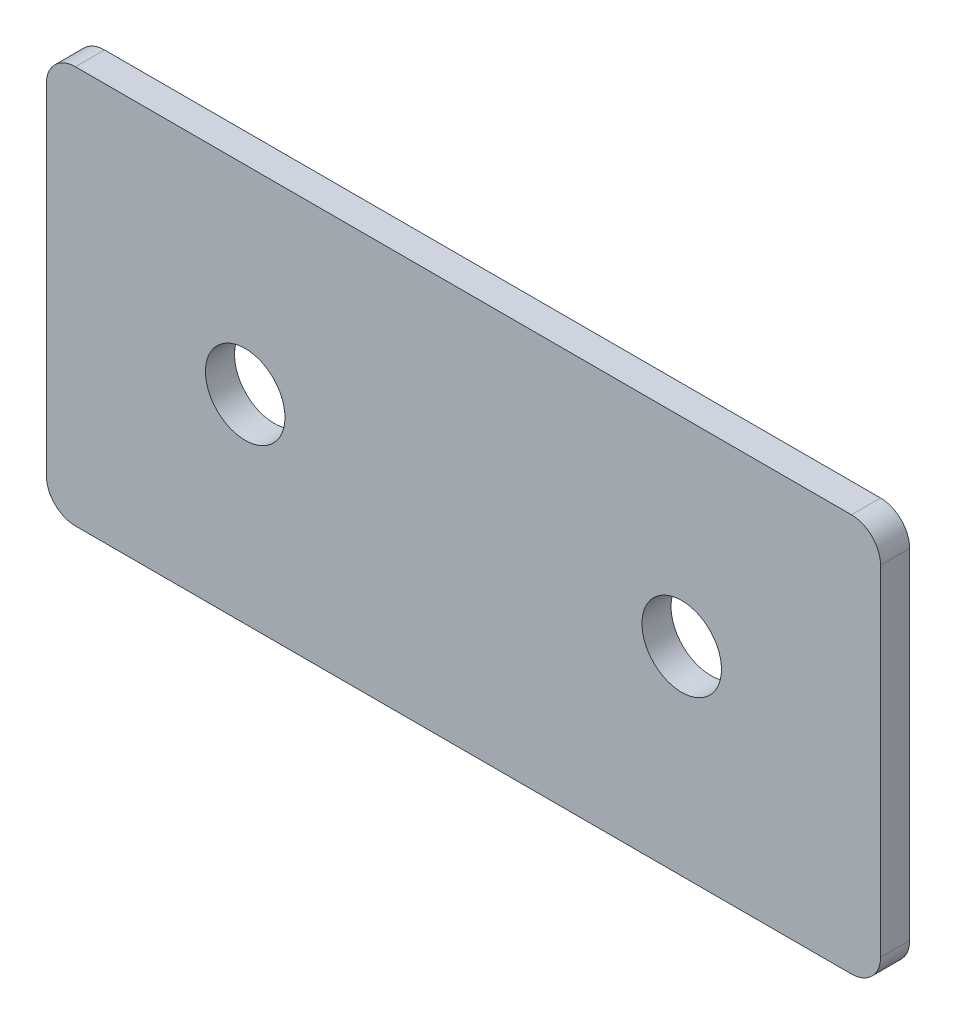
ISO-10303-21;
HEADER;
FILE_DESCRIPTION(('STEP AP214'),'2;1');
FILE_NAME('part.step','',(''),(''),'','','');
FILE_SCHEMA(('AUTOMOTIVE_DESIGN { 1 0 10303 214 1 1 1 1 }'));
ENDSEC;
DATA;
#1=APPLICATION_CONTEXT('core data for automotive mechanical design processes');
#2=APPLICATION_PROTOCOL_DEFINITION('international standard','automotive_design',2000,#1);
#3=PRODUCT_CONTEXT('',#1,'mechanical');
#4=PRODUCT('Part','Part','',(#3));
#5=PRODUCT_RELATED_PRODUCT_CATEGORY('part','',(#4));
#6=PRODUCT_DEFINITION_FORMATION('','',#4);
#7=PRODUCT_DEFINITION_CONTEXT('part definition',#1,'design');
#8=PRODUCT_DEFINITION('design','',#6,#7);
#9=PRODUCT_DEFINITION_SHAPE('','',#8);
#10=(LENGTH_UNIT() NAMED_UNIT(*) SI_UNIT(.MILLI.,.METRE.));
#11=(NAMED_UNIT(*) PLANE_ANGLE_UNIT() SI_UNIT($,.RADIAN.));
#12=(NAMED_UNIT(*) SI_UNIT($,.STERADIAN.) SOLID_ANGLE_UNIT());
#13=UNCERTAINTY_MEASURE_WITH_UNIT(LENGTH_MEASURE(1.E-05),#10,'distance_accuracy_value','');
#14=(GEOMETRIC_REPRESENTATION_CONTEXT(3) GLOBAL_UNCERTAINTY_ASSIGNED_CONTEXT((#13)) GLOBAL_UNIT_ASSIGNED_CONTEXT((#10,
#11,#12)) REPRESENTATION_CONTEXT('',''));
#15=CARTESIAN_POINT('',(0.,0.,0.));
#16=DIRECTION('',(0.,0.,1.));
#17=DIRECTION('',(1.,0.,0.));
#18=AXIS2_PLACEMENT_3D('',#15,#16,#17);
#19=CARTESIAN_POINT('',(0.,0.,3.));
#20=DIRECTION('',(0.,0.,-1.));
#21=DIRECTION('',(-1.,0.,0.));
#22=AXIS2_PLACEMENT_3D('',#19,#20,#21);
#23=PLANE('',#22);
#24=CARTESIAN_POINT('',(45.,0.,3.));
#25=DIRECTION('',(0.,0.,1.));
#26=DIRECTION('',(1.,0.,0.));
#27=AXIS2_PLACEMENT_3D('',#24,#25,#26);
#28=CIRCLE('',#27,4.1);
#29=CARTESIAN_POINT('',(49.1,0.,3.));
#30=VERTEX_POINT('',#29);
#31=EDGE_CURVE('E154',#30,#30,#28,.T.);
#32=ORIENTED_EDGE('',*,*,#31,.F.);
#33=EDGE_LOOP('',(#32));
#34=FACE_BOUND('',#33,.T.);
#35=CARTESIAN_POINT('',(0.,0.,3.));
#36=DIRECTION('',(0.,0.,1.));
#37=DIRECTION('',(1.,0.,0.));
#38=AXIS2_PLACEMENT_3D('',#35,#36,#37);
#39=CIRCLE('',#38,4.1);
#40=CARTESIAN_POINT('',(4.1,0.,3.));
#41=VERTEX_POINT('',#40);
#42=EDGE_CURVE('E107',#41,#41,#39,.T.);
#43=ORIENTED_EDGE('',*,*,#42,.F.);
#44=EDGE_LOOP('',(#43));
#45=FACE_BOUND('',#44,.T.);
#46=DIRECTION('',(1.,0.,0.));
#47=VECTOR('',#46,1.);
#48=CARTESIAN_POINT('',(-20.5,-20.5,3.));
#49=LINE('',#48,#47);
#50=CARTESIAN_POINT('',(-17.5,-20.5,3.));
#51=VERTEX_POINT('',#50);
#52=CARTESIAN_POINT('',(62.5,-20.5,3.));
#53=VERTEX_POINT('',#52);
#54=EDGE_CURVE('E84',#51,#53,#49,.T.);
#55=ORIENTED_EDGE('',*,*,#54,.T.);
#56=CARTESIAN_POINT('',(62.5,-17.5,3.));
#57=DIRECTION('',(0.,0.,-1.));
#58=DIRECTION('',(-1.,0.,0.));
#59=AXIS2_PLACEMENT_3D('',#56,#57,#58);
#60=CIRCLE('',#59,3.);
#61=CARTESIAN_POINT('',(65.5,-17.5,3.));
#62=VERTEX_POINT('',#61);
#63=EDGE_CURVE('E91',#53,#62,#60,.F.);
#64=ORIENTED_EDGE('',*,*,#63,.T.);
#65=DIRECTION('',(0.,1.,0.));
#66=VECTOR('',#65,1.);
#67=CARTESIAN_POINT('',(65.5,-20.5,3.));
#68=LINE('',#67,#66);
#69=CARTESIAN_POINT('',(65.5,17.5,3.));
#70=VERTEX_POINT('',#69);
#71=EDGE_CURVE('E102',#62,#70,#68,.T.);
#72=ORIENTED_EDGE('',*,*,#71,.T.);
#73=CARTESIAN_POINT('',(62.5,17.5,3.));
#74=DIRECTION('',(0.,0.,-1.));
#75=DIRECTION('',(-1.,0.,0.));
#76=AXIS2_PLACEMENT_3D('',#73,#74,#75);
#77=CIRCLE('',#76,3.);
#78=CARTESIAN_POINT('',(62.5,20.5,3.));
#79=VERTEX_POINT('',#78);
#80=EDGE_CURVE('E109',#70,#79,#77,.F.);
#81=ORIENTED_EDGE('',*,*,#80,.T.);
#82=DIRECTION('',(-1.,0.,0.));
#83=VECTOR('',#82,1.);
#84=CARTESIAN_POINT('',(65.5,20.5,3.));
#85=LINE('',#84,#83);
#86=CARTESIAN_POINT('',(-17.5,20.5,3.));
#87=VERTEX_POINT('',#86);
#88=EDGE_CURVE('E139',#79,#87,#85,.T.);
#89=ORIENTED_EDGE('',*,*,#88,.T.);
#90=CARTESIAN_POINT('',(-17.5,17.5,3.));
#91=DIRECTION('',(0.,0.,-1.));
#92=DIRECTION('',(-1.,0.,0.));
#93=AXIS2_PLACEMENT_3D('',#90,#91,#92);
#94=CIRCLE('',#93,3.);
#95=CARTESIAN_POINT('',(-20.5,17.5,3.));
#96=VERTEX_POINT('',#95);
#97=EDGE_CURVE('E92',#87,#96,#94,.F.);
#98=ORIENTED_EDGE('',*,*,#97,.T.);
#99=DIRECTION('',(0.,-1.,0.));
#100=VECTOR('',#99,1.);
#101=CARTESIAN_POINT('',(-20.5,20.5,3.));
#102=LINE('',#101,#100);
#103=CARTESIAN_POINT('',(-20.5,-17.5,3.));
#104=VERTEX_POINT('',#103);
#105=EDGE_CURVE('E86',#96,#104,#102,.T.);
#106=ORIENTED_EDGE('',*,*,#105,.T.);
#107=CARTESIAN_POINT('',(-17.5,-17.5,3.));
#108=DIRECTION('',(0.,0.,-1.));
#109=DIRECTION('',(-1.,0.,0.));
#110=AXIS2_PLACEMENT_3D('',#107,#108,#109);
#111=CIRCLE('',#110,3.);
#112=EDGE_CURVE('E82',#104,#51,#111,.F.);
#113=ORIENTED_EDGE('',*,*,#112,.T.);
#114=EDGE_LOOP('',(#55,#64,#72,#81,#89,#98,#106,#113));
#115=FACE_BOUND('',#114,.T.);
#116=ADVANCED_FACE('F16',(#34,#45,#115),#23,.F.);
#117=CARTESIAN_POINT('',(0.,0.,0.));
#118=DIRECTION('',(0.,0.,-1.));
#119=DIRECTION('',(-1.,0.,0.));
#120=AXIS2_PLACEMENT_3D('',#117,#118,#119);
#121=PLANE('',#120);
#122=CARTESIAN_POINT('',(45.,0.,0.));
#123=DIRECTION('',(0.,0.,1.));
#124=DIRECTION('',(1.,0.,0.));
#125=AXIS2_PLACEMENT_3D('',#122,#123,#124);
#126=CIRCLE('',#125,4.1);
#127=CARTESIAN_POINT('',(49.1,0.,0.));
#128=VERTEX_POINT('',#127);
#129=EDGE_CURVE('E150',#128,#128,#126,.T.);
#130=ORIENTED_EDGE('',*,*,#129,.T.);
#131=EDGE_LOOP('',(#130));
#132=FACE_BOUND('',#131,.T.);
#133=CARTESIAN_POINT('',(0.,0.,0.));
#134=DIRECTION('',(0.,0.,1.));
#135=DIRECTION('',(1.,0.,0.));
#136=AXIS2_PLACEMENT_3D('',#133,#134,#135);
#137=CIRCLE('',#136,4.1);
#138=CARTESIAN_POINT('',(4.1,0.,0.));
#139=VERTEX_POINT('',#138);
#140=EDGE_CURVE('E112',#139,#139,#137,.T.);
#141=ORIENTED_EDGE('',*,*,#140,.T.);
#142=EDGE_LOOP('',(#141));
#143=FACE_BOUND('',#142,.T.);
#144=DIRECTION('',(0.,1.,0.));
#145=VECTOR('',#144,1.);
#146=CARTESIAN_POINT('',(65.5,-20.5,0.));
#147=LINE('',#146,#145);
#148=CARTESIAN_POINT('',(65.5,-17.5,0.));
#149=VERTEX_POINT('',#148);
#150=CARTESIAN_POINT('',(65.5,17.5,0.));
#151=VERTEX_POINT('',#150);
#152=EDGE_CURVE('E141',#149,#151,#147,.T.);
#153=ORIENTED_EDGE('',*,*,#152,.F.);
#154=CARTESIAN_POINT('',(62.5,-17.5,0.));
#155=DIRECTION('',(0.,0.,-1.));
#156=DIRECTION('',(-1.,0.,0.));
#157=AXIS2_PLACEMENT_3D('',#154,#155,#156);
#158=CIRCLE('',#157,3.);
#159=CARTESIAN_POINT('',(62.5,-20.5,0.));
#160=VERTEX_POINT('',#159);
#161=EDGE_CURVE('E128',#149,#160,#158,.T.);
#162=ORIENTED_EDGE('',*,*,#161,.T.);
#163=DIRECTION('',(1.,0.,0.));
#164=VECTOR('',#163,1.);
#165=CARTESIAN_POINT('',(-20.5,-20.5,0.));
#166=LINE('',#165,#164);
#167=CARTESIAN_POINT('',(-17.5,-20.5,0.));
#168=VERTEX_POINT('',#167);
#169=EDGE_CURVE('E138',#168,#160,#166,.T.);
#170=ORIENTED_EDGE('',*,*,#169,.F.);
#171=CARTESIAN_POINT('',(-17.5,-17.5,0.));
#172=DIRECTION('',(0.,0.,-1.));
#173=DIRECTION('',(-1.,0.,0.));
#174=AXIS2_PLACEMENT_3D('',#171,#172,#173);
#175=CIRCLE('',#174,3.);
#176=CARTESIAN_POINT('',(-20.5,-17.5,0.));
#177=VERTEX_POINT('',#176);
#178=EDGE_CURVE('E106',#168,#177,#175,.T.);
#179=ORIENTED_EDGE('',*,*,#178,.T.);
#180=DIRECTION('',(0.,-1.,0.));
#181=VECTOR('',#180,1.);
#182=CARTESIAN_POINT('',(-20.5,20.5,0.));
#183=LINE('',#182,#181);
#184=CARTESIAN_POINT('',(-20.5,17.5,0.));
#185=VERTEX_POINT('',#184);
#186=EDGE_CURVE('E137',#185,#177,#183,.T.);
#187=ORIENTED_EDGE('',*,*,#186,.F.);
#188=CARTESIAN_POINT('',(-17.5,17.5,0.));
#189=DIRECTION('',(0.,0.,-1.));
#190=DIRECTION('',(-1.,0.,0.));
#191=AXIS2_PLACEMENT_3D('',#188,#189,#190);
#192=CIRCLE('',#191,3.);
#193=CARTESIAN_POINT('',(-17.5,20.5,0.));
#194=VERTEX_POINT('',#193);
#195=EDGE_CURVE('E31',#185,#194,#192,.T.);
#196=ORIENTED_EDGE('',*,*,#195,.T.);
#197=DIRECTION('',(-1.,0.,0.));
#198=VECTOR('',#197,1.);
#199=CARTESIAN_POINT('',(65.5,20.5,0.));
#200=LINE('',#199,#198);
#201=CARTESIAN_POINT('',(62.5,20.5,0.));
#202=VERTEX_POINT('',#201);
#203=EDGE_CURVE('E148',#202,#194,#200,.T.);
#204=ORIENTED_EDGE('',*,*,#203,.F.);
#205=CARTESIAN_POINT('',(62.5,17.5,0.));
#206=DIRECTION('',(0.,0.,-1.));
#207=DIRECTION('',(-1.,0.,0.));
#208=AXIS2_PLACEMENT_3D('',#205,#206,#207);
#209=CIRCLE('',#208,3.);
#210=EDGE_CURVE('E124',#202,#151,#209,.T.);
#211=ORIENTED_EDGE('',*,*,#210,.T.);
#212=EDGE_LOOP('',(#153,#162,#170,#179,#187,#196,#204,#211));
#213=FACE_BOUND('',#212,.T.);
#214=ADVANCED_FACE('F160',(#132,#143,#213),#121,.T.);
#215=CARTESIAN_POINT('',(0.,0.,3.));
#216=DIRECTION('',(0.,0.,-1.));
#217=DIRECTION('',(-1.,0.,0.));
#218=AXIS2_PLACEMENT_3D('',#215,#216,#217);
#219=CYLINDRICAL_SURFACE('',#218,4.1);
#220=ORIENTED_EDGE('',*,*,#42,.T.);
#221=EDGE_LOOP('',(#220));
#222=FACE_BOUND('',#221,.T.);
#223=ORIENTED_EDGE('',*,*,#140,.F.);
#224=EDGE_LOOP('',(#223));
#225=FACE_BOUND('',#224,.T.);
#226=ADVANCED_FACE('F165',(#222,#225),#219,.F.);
#227=CARTESIAN_POINT('',(45.,0.,3.));
#228=DIRECTION('',(0.,0.,-1.));
#229=DIRECTION('',(-1.,0.,0.));
#230=AXIS2_PLACEMENT_3D('',#227,#228,#229);
#231=CYLINDRICAL_SURFACE('',#230,4.1);
#232=ORIENTED_EDGE('',*,*,#31,.T.);
#233=EDGE_LOOP('',(#232));
#234=FACE_BOUND('',#233,.T.);
#235=ORIENTED_EDGE('',*,*,#129,.F.);
#236=EDGE_LOOP('',(#235));
#237=FACE_BOUND('',#236,.T.);
#238=ADVANCED_FACE('F163',(#234,#237),#231,.F.);
#239=CARTESIAN_POINT('',(-20.5,20.5,0.));
#240=DIRECTION('',(-1.,0.,0.));
#241=DIRECTION('',(0.,0.,1.));
#242=AXIS2_PLACEMENT_3D('',#239,#240,#241);
#243=PLANE('',#242);
#244=ORIENTED_EDGE('',*,*,#186,.T.);
#245=DIRECTION('',(0.,0.,1.));
#246=VECTOR('',#245,1.);
#247=CARTESIAN_POINT('',(-20.5,-17.5,0.));
#248=LINE('',#247,#246);
#249=EDGE_CURVE('E132',#177,#104,#248,.T.);
#250=ORIENTED_EDGE('',*,*,#249,.T.);
#251=ORIENTED_EDGE('',*,*,#105,.F.);
#252=DIRECTION('',(0.,0.,1.));
#253=VECTOR('',#252,1.);
#254=CARTESIAN_POINT('',(-20.5,17.5,0.));
#255=LINE('',#254,#253);
#256=EDGE_CURVE('E130',#96,#185,#255,.F.);
#257=ORIENTED_EDGE('',*,*,#256,.T.);
#258=EDGE_LOOP('',(#244,#250,#251,#257));
#259=FACE_BOUND('',#258,.T.);
#260=ADVANCED_FACE('F135',(#259),#243,.T.);
#261=CARTESIAN_POINT('',(65.5,20.5,0.));
#262=DIRECTION('',(0.,1.,0.));
#263=DIRECTION('',(0.,0.,1.));
#264=AXIS2_PLACEMENT_3D('',#261,#262,#263);
#265=PLANE('',#264);
#266=ORIENTED_EDGE('',*,*,#203,.T.);
#267=DIRECTION('',(0.,0.,1.));
#268=VECTOR('',#267,1.);
#269=CARTESIAN_POINT('',(-17.5,20.5,0.));
#270=LINE('',#269,#268);
#271=EDGE_CURVE('E10',#194,#87,#270,.T.);
#272=ORIENTED_EDGE('',*,*,#271,.T.);
#273=ORIENTED_EDGE('',*,*,#88,.F.);
#274=DIRECTION('',(0.,0.,1.));
#275=VECTOR('',#274,1.);
#276=CARTESIAN_POINT('',(62.5,20.5,0.));
#277=LINE('',#276,#275);
#278=EDGE_CURVE('E24',#79,#202,#277,.F.);
#279=ORIENTED_EDGE('',*,*,#278,.T.);
#280=EDGE_LOOP('',(#266,#272,#273,#279));
#281=FACE_BOUND('',#280,.T.);
#282=ADVANCED_FACE('F173',(#281),#265,.T.);
#283=CARTESIAN_POINT('',(65.5,-20.5,0.));
#284=DIRECTION('',(1.,0.,0.));
#285=DIRECTION('',(0.,0.,-1.));
#286=AXIS2_PLACEMENT_3D('',#283,#284,#285);
#287=PLANE('',#286);
#288=ORIENTED_EDGE('',*,*,#71,.F.);
#289=DIRECTION('',(0.,0.,1.));
#290=VECTOR('',#289,1.);
#291=CARTESIAN_POINT('',(65.5,-17.5,0.));
#292=LINE('',#291,#290);
#293=EDGE_CURVE('E122',#62,#149,#292,.F.);
#294=ORIENTED_EDGE('',*,*,#293,.T.);
#295=ORIENTED_EDGE('',*,*,#152,.T.);
#296=DIRECTION('',(0.,0.,1.));
#297=VECTOR('',#296,1.);
#298=CARTESIAN_POINT('',(65.5,17.5,0.));
#299=LINE('',#298,#297);
#300=EDGE_CURVE('E119',#151,#70,#299,.T.);
#301=ORIENTED_EDGE('',*,*,#300,.T.);
#302=EDGE_LOOP('',(#288,#294,#295,#301));
#303=FACE_BOUND('',#302,.T.);
#304=ADVANCED_FACE('F204',(#303),#287,.T.);
#305=CARTESIAN_POINT('',(-20.5,-20.5,0.));
#306=DIRECTION('',(0.,-1.,0.));
#307=DIRECTION('',(0.,0.,-1.));
#308=AXIS2_PLACEMENT_3D('',#305,#306,#307);
#309=PLANE('',#308);
#310=ORIENTED_EDGE('',*,*,#169,.T.);
#311=DIRECTION('',(0.,0.,1.));
#312=VECTOR('',#311,1.);
#313=CARTESIAN_POINT('',(62.5,-20.5,0.));
#314=LINE('',#313,#312);
#315=EDGE_CURVE('E101',#160,#53,#314,.T.);
#316=ORIENTED_EDGE('',*,*,#315,.T.);
#317=ORIENTED_EDGE('',*,*,#54,.F.);
#318=DIRECTION('',(0.,0.,1.));
#319=VECTOR('',#318,1.);
#320=CARTESIAN_POINT('',(-17.5,-20.5,0.));
#321=LINE('',#320,#319);
#322=EDGE_CURVE('E98',#51,#168,#321,.F.);
#323=ORIENTED_EDGE('',*,*,#322,.T.);
#324=EDGE_LOOP('',(#310,#316,#317,#323));
#325=FACE_BOUND('',#324,.T.);
#326=ADVANCED_FACE('F97',(#325),#309,.T.);
#327=CARTESIAN_POINT('',(62.5,-17.5,0.));
#328=DIRECTION('',(0.,0.,1.));
#329=DIRECTION('',(1.,0.,0.));
#330=AXIS2_PLACEMENT_3D('',#327,#328,#329);
#331=CYLINDRICAL_SURFACE('',#330,3.);
#332=ORIENTED_EDGE('',*,*,#161,.F.);
#333=ORIENTED_EDGE('',*,*,#293,.F.);
#334=ORIENTED_EDGE('',*,*,#63,.F.);
#335=ORIENTED_EDGE('',*,*,#315,.F.);
#336=EDGE_LOOP('',(#332,#333,#334,#335));
#337=FACE_BOUND('',#336,.T.);
#338=ADVANCED_FACE('F187',(#337),#331,.T.);
#339=CARTESIAN_POINT('',(-17.5,-17.5,0.));
#340=DIRECTION('',(0.,0.,1.));
#341=DIRECTION('',(1.,0.,0.));
#342=AXIS2_PLACEMENT_3D('',#339,#340,#341);
#343=CYLINDRICAL_SURFACE('',#342,3.);
#344=ORIENTED_EDGE('',*,*,#178,.F.);
#345=ORIENTED_EDGE('',*,*,#322,.F.);
#346=ORIENTED_EDGE('',*,*,#112,.F.);
#347=ORIENTED_EDGE('',*,*,#249,.F.);
#348=EDGE_LOOP('',(#344,#345,#346,#347));
#349=FACE_BOUND('',#348,.T.);
#350=ADVANCED_FACE('F105',(#349),#343,.T.);
#351=CARTESIAN_POINT('',(-17.5,17.5,0.));
#352=DIRECTION('',(0.,0.,1.));
#353=DIRECTION('',(1.,0.,0.));
#354=AXIS2_PLACEMENT_3D('',#351,#352,#353);
#355=CYLINDRICAL_SURFACE('',#354,3.);
#356=ORIENTED_EDGE('',*,*,#195,.F.);
#357=ORIENTED_EDGE('',*,*,#256,.F.);
#358=ORIENTED_EDGE('',*,*,#97,.F.);
#359=ORIENTED_EDGE('',*,*,#271,.F.);
#360=EDGE_LOOP('',(#356,#357,#358,#359));
#361=FACE_BOUND('',#360,.T.);
#362=ADVANCED_FACE('F192',(#361),#355,.T.);
#363=CARTESIAN_POINT('',(62.5,17.5,0.));
#364=DIRECTION('',(0.,0.,1.));
#365=DIRECTION('',(1.,0.,0.));
#366=AXIS2_PLACEMENT_3D('',#363,#364,#365);
#367=CYLINDRICAL_SURFACE('',#366,3.);
#368=ORIENTED_EDGE('',*,*,#210,.F.);
#369=ORIENTED_EDGE('',*,*,#278,.F.);
#370=ORIENTED_EDGE('',*,*,#80,.F.);
#371=ORIENTED_EDGE('',*,*,#300,.F.);
#372=EDGE_LOOP('',(#368,#369,#370,#371));
#373=FACE_BOUND('',#372,.T.);
#374=ADVANCED_FACE('F18',(#373),#367,.T.);
#375=CLOSED_SHELL('',(#116,#214,#226,#238,#260,#282,#304,#326,#338,#350,#362,#374));
#376=MANIFOLD_SOLID_BREP('B1',#375);
#377=ADVANCED_BREP_SHAPE_REPRESENTATION('',(#18,#376),#14);
#378=SHAPE_DEFINITION_REPRESENTATION(#9,#377);
ENDSEC;
END-ISO-10303-21;
